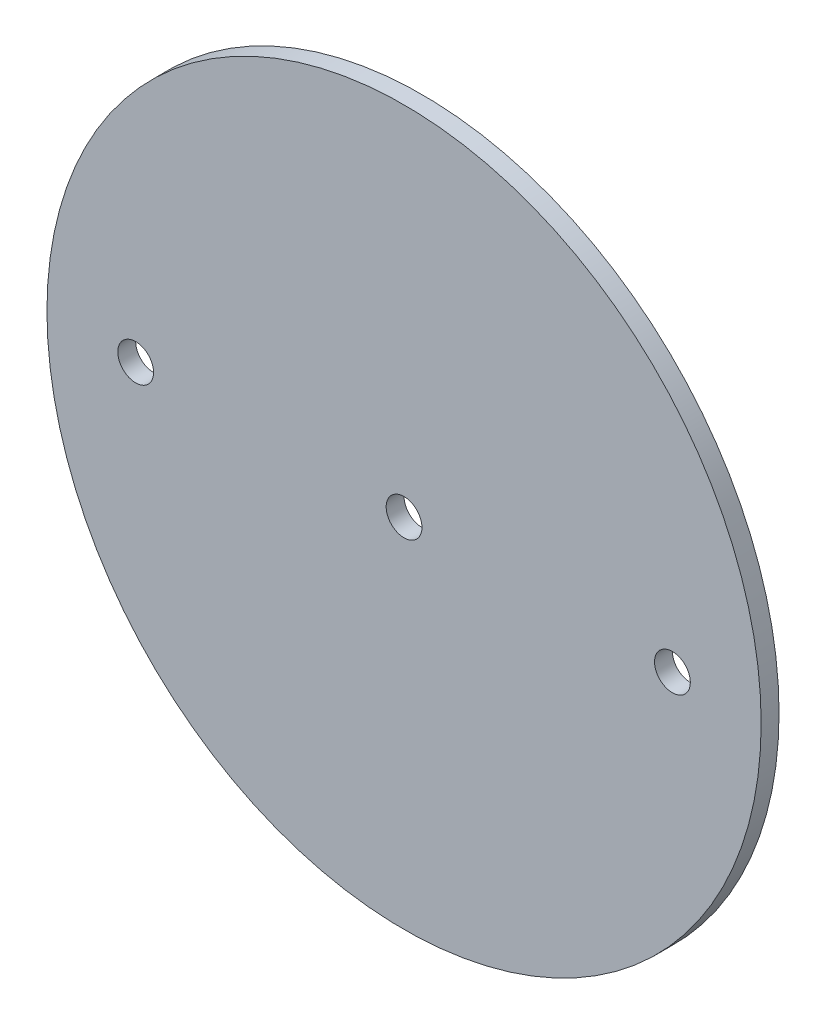
ISO-10303-21;
HEADER;
FILE_DESCRIPTION(('STEP AP214'),'2;1');
FILE_NAME('part.step','',(''),(''),'','','');
FILE_SCHEMA(('AUTOMOTIVE_DESIGN { 1 0 10303 214 1 1 1 1 }'));
ENDSEC;
DATA;
#1=APPLICATION_CONTEXT('core data for automotive mechanical design processes');
#2=APPLICATION_PROTOCOL_DEFINITION('international standard','automotive_design',2000,#1);
#3=PRODUCT_CONTEXT('',#1,'mechanical');
#4=PRODUCT('Part','Part','',(#3));
#5=PRODUCT_RELATED_PRODUCT_CATEGORY('part','',(#4));
#6=PRODUCT_DEFINITION_FORMATION('','',#4);
#7=PRODUCT_DEFINITION_CONTEXT('part definition',#1,'design');
#8=PRODUCT_DEFINITION('design','',#6,#7);
#9=PRODUCT_DEFINITION_SHAPE('','',#8);
#10=(LENGTH_UNIT() NAMED_UNIT(*) SI_UNIT(.MILLI.,.METRE.));
#11=(NAMED_UNIT(*) PLANE_ANGLE_UNIT() SI_UNIT($,.RADIAN.));
#12=(NAMED_UNIT(*) SI_UNIT($,.STERADIAN.) SOLID_ANGLE_UNIT());
#13=UNCERTAINTY_MEASURE_WITH_UNIT(LENGTH_MEASURE(1.E-05),#10,'distance_accuracy_value','');
#14=(GEOMETRIC_REPRESENTATION_CONTEXT(3) GLOBAL_UNCERTAINTY_ASSIGNED_CONTEXT((#13)) GLOBAL_UNIT_ASSIGNED_CONTEXT((#10,
#11,#12)) REPRESENTATION_CONTEXT('',''));
#15=CARTESIAN_POINT('',(0.,0.,0.));
#16=DIRECTION('',(0.,0.,1.));
#17=DIRECTION('',(1.,0.,0.));
#18=AXIS2_PLACEMENT_3D('',#15,#16,#17);
#19=CARTESIAN_POINT('',(0.,0.,1.5875));
#20=DIRECTION('',(0.,0.,-1.));
#21=DIRECTION('',(-1.,0.,0.));
#22=AXIS2_PLACEMENT_3D('',#19,#20,#21);
#23=CYLINDRICAL_SURFACE('',#22,63.373);
#24=CARTESIAN_POINT('',(0.,0.,1.5875));
#25=DIRECTION('',(0.,0.,1.));
#26=DIRECTION('',(1.,0.,0.));
#27=AXIS2_PLACEMENT_3D('',#24,#25,#26);
#28=CIRCLE('',#27,63.373);
#29=CARTESIAN_POINT('',(63.373,0.,1.5875));
#30=VERTEX_POINT('',#29);
#31=EDGE_CURVE('E10',#30,#30,#28,.T.);
#32=ORIENTED_EDGE('',*,*,#31,.F.);
#33=EDGE_LOOP('',(#32));
#34=FACE_BOUND('',#33,.T.);
#35=CARTESIAN_POINT('',(0.,0.,-1.5875));
#36=DIRECTION('',(0.,0.,1.));
#37=DIRECTION('',(1.,0.,0.));
#38=AXIS2_PLACEMENT_3D('',#35,#36,#37);
#39=CIRCLE('',#38,63.373);
#40=CARTESIAN_POINT('',(63.373,0.,-1.5875));
#41=VERTEX_POINT('',#40);
#42=EDGE_CURVE('E40',#41,#41,#39,.T.);
#43=ORIENTED_EDGE('',*,*,#42,.T.);
#44=EDGE_LOOP('',(#43));
#45=FACE_BOUND('',#44,.T.);
#46=ADVANCED_FACE('F37',(#34,#45),#23,.T.);
#47=CARTESIAN_POINT('',(0.,0.,1.5875));
#48=DIRECTION('',(0.,0.,1.));
#49=DIRECTION('',(1.,0.,0.));
#50=AXIS2_PLACEMENT_3D('',#47,#48,#49);
#51=PLANE('',#50);
#52=CARTESIAN_POINT('',(0.,0.,1.5875));
#53=DIRECTION('',(0.,0.,1.));
#54=DIRECTION('',(1.,0.,0.));
#55=AXIS2_PLACEMENT_3D('',#52,#53,#54);
#56=CIRCLE('',#55,3.17499999999999);
#57=CARTESIAN_POINT('',(3.17499999999999,0.,1.5875));
#58=VERTEX_POINT('',#57);
#59=EDGE_CURVE('E63',#58,#58,#56,.T.);
#60=ORIENTED_EDGE('',*,*,#59,.F.);
#61=EDGE_LOOP('',(#60));
#62=FACE_BOUND('',#61,.T.);
#63=CARTESIAN_POINT('',(47.625,0.,1.5875));
#64=DIRECTION('',(0.,0.,1.));
#65=DIRECTION('',(1.,0.,0.));
#66=AXIS2_PLACEMENT_3D('',#63,#64,#65);
#67=CIRCLE('',#66,3.17499999999998);
#68=CARTESIAN_POINT('',(50.8,0.,1.5875));
#69=VERTEX_POINT('',#68);
#70=EDGE_CURVE('E57',#69,#69,#67,.T.);
#71=ORIENTED_EDGE('',*,*,#70,.F.);
#72=EDGE_LOOP('',(#71));
#73=FACE_BOUND('',#72,.T.);
#74=CARTESIAN_POINT('',(-47.625,0.,1.5875));
#75=DIRECTION('',(0.,0.,1.));
#76=DIRECTION('',(1.,0.,0.));
#77=AXIS2_PLACEMENT_3D('',#74,#75,#76);
#78=CIRCLE('',#77,3.17499999999998);
#79=CARTESIAN_POINT('',(-44.45,0.,1.5875));
#80=VERTEX_POINT('',#79);
#81=EDGE_CURVE('E51',#80,#80,#78,.T.);
#82=ORIENTED_EDGE('',*,*,#81,.F.);
#83=EDGE_LOOP('',(#82));
#84=FACE_BOUND('',#83,.T.);
#85=ORIENTED_EDGE('',*,*,#31,.T.);
#86=EDGE_LOOP('',(#85));
#87=FACE_BOUND('',#86,.T.);
#88=ADVANCED_FACE('F69',(#62,#73,#84,#87),#51,.T.);
#89=CARTESIAN_POINT('',(0.,0.,-1.5875));
#90=DIRECTION('',(0.,0.,1.));
#91=DIRECTION('',(1.,0.,0.));
#92=AXIS2_PLACEMENT_3D('',#89,#90,#91);
#93=PLANE('',#92);
#94=CARTESIAN_POINT('',(0.,0.,-1.5875));
#95=DIRECTION('',(0.,0.,1.));
#96=DIRECTION('',(1.,0.,0.));
#97=AXIS2_PLACEMENT_3D('',#94,#95,#96);
#98=CIRCLE('',#97,3.17499999999999);
#99=CARTESIAN_POINT('',(3.17499999999999,0.,-1.5875));
#100=VERTEX_POINT('',#99);
#101=EDGE_CURVE('E60',#100,#100,#98,.T.);
#102=ORIENTED_EDGE('',*,*,#101,.T.);
#103=EDGE_LOOP('',(#102));
#104=FACE_BOUND('',#103,.T.);
#105=CARTESIAN_POINT('',(47.625,0.,-1.5875));
#106=DIRECTION('',(0.,0.,1.));
#107=DIRECTION('',(1.,0.,0.));
#108=AXIS2_PLACEMENT_3D('',#105,#106,#107);
#109=CIRCLE('',#108,3.17499999999999);
#110=CARTESIAN_POINT('',(50.8,0.,-1.5875));
#111=VERTEX_POINT('',#110);
#112=EDGE_CURVE('E54',#111,#111,#109,.T.);
#113=ORIENTED_EDGE('',*,*,#112,.T.);
#114=EDGE_LOOP('',(#113));
#115=FACE_BOUND('',#114,.T.);
#116=CARTESIAN_POINT('',(-47.625,0.,-1.5875));
#117=DIRECTION('',(0.,0.,1.));
#118=DIRECTION('',(1.,0.,0.));
#119=AXIS2_PLACEMENT_3D('',#116,#117,#118);
#120=CIRCLE('',#119,3.17499999999999);
#121=CARTESIAN_POINT('',(-44.45,0.,-1.5875));
#122=VERTEX_POINT('',#121);
#123=EDGE_CURVE('E47',#122,#122,#120,.T.);
#124=ORIENTED_EDGE('',*,*,#123,.T.);
#125=EDGE_LOOP('',(#124));
#126=FACE_BOUND('',#125,.T.);
#127=ORIENTED_EDGE('',*,*,#42,.F.);
#128=EDGE_LOOP('',(#127));
#129=FACE_BOUND('',#128,.T.);
#130=ADVANCED_FACE('F72',(#104,#115,#126,#129),#93,.F.);
#131=CARTESIAN_POINT('',(-47.625,0.,1.5875));
#132=DIRECTION('',(0.,0.,1.));
#133=DIRECTION('',(1.,0.,0.));
#134=AXIS2_PLACEMENT_3D('',#131,#132,#133);
#135=CYLINDRICAL_SURFACE('',#134,3.17499999999999);
#136=ORIENTED_EDGE('',*,*,#123,.F.);
#137=EDGE_LOOP('',(#136));
#138=FACE_BOUND('',#137,.T.);
#139=ORIENTED_EDGE('',*,*,#81,.T.);
#140=EDGE_LOOP('',(#139));
#141=FACE_BOUND('',#140,.T.);
#142=ADVANCED_FACE('F78',(#138,#141),#135,.F.);
#143=CARTESIAN_POINT('',(47.625,0.,1.5875));
#144=DIRECTION('',(0.,0.,1.));
#145=DIRECTION('',(1.,0.,0.));
#146=AXIS2_PLACEMENT_3D('',#143,#144,#145);
#147=CYLINDRICAL_SURFACE('',#146,3.17499999999999);
#148=ORIENTED_EDGE('',*,*,#112,.F.);
#149=EDGE_LOOP('',(#148));
#150=FACE_BOUND('',#149,.T.);
#151=ORIENTED_EDGE('',*,*,#70,.T.);
#152=EDGE_LOOP('',(#151));
#153=FACE_BOUND('',#152,.T.);
#154=ADVANCED_FACE('F80',(#150,#153),#147,.F.);
#155=CARTESIAN_POINT('',(0.,0.,1.5875));
#156=DIRECTION('',(0.,0.,1.));
#157=DIRECTION('',(1.,0.,0.));
#158=AXIS2_PLACEMENT_3D('',#155,#156,#157);
#159=CYLINDRICAL_SURFACE('',#158,3.17499999999999);
#160=ORIENTED_EDGE('',*,*,#101,.F.);
#161=EDGE_LOOP('',(#160));
#162=FACE_BOUND('',#161,.T.);
#163=ORIENTED_EDGE('',*,*,#59,.T.);
#164=EDGE_LOOP('',(#163));
#165=FACE_BOUND('',#164,.T.);
#166=ADVANCED_FACE('F67',(#162,#165),#159,.F.);
#167=CLOSED_SHELL('',(#46,#88,#130,#142,#154,#166));
#168=MANIFOLD_SOLID_BREP('B2',#167);
#169=ADVANCED_BREP_SHAPE_REPRESENTATION('',(#18,#168),#14);
#170=SHAPE_DEFINITION_REPRESENTATION(#9,#169);
ENDSEC;
END-ISO-10303-21;
